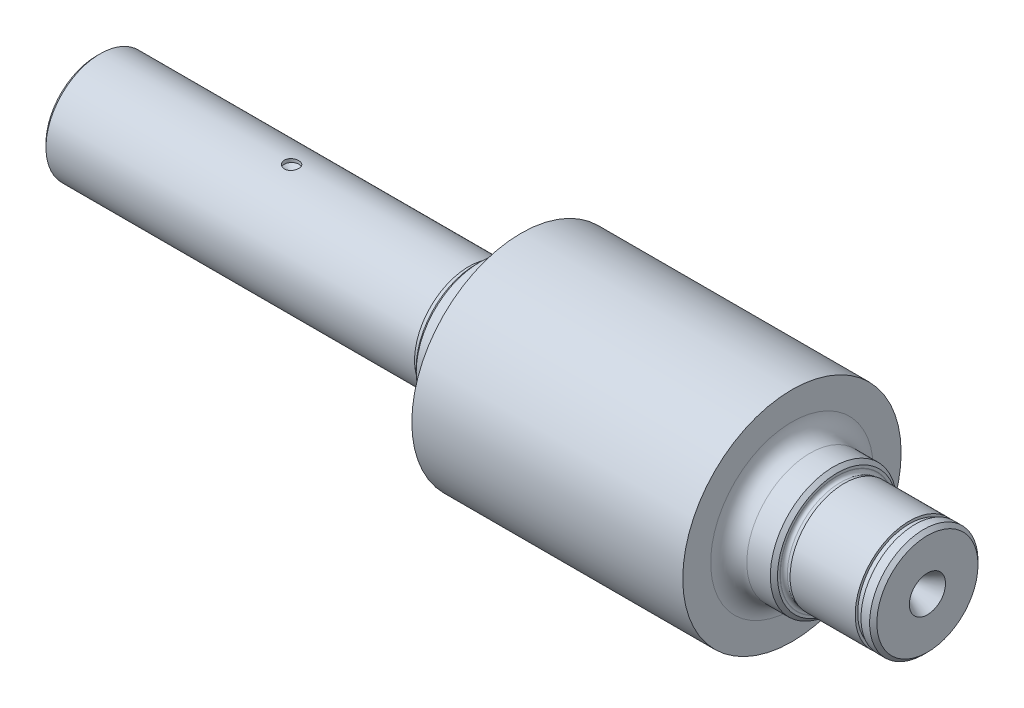
ISO-10303-21;
HEADER;
FILE_DESCRIPTION(('STEP AP214'),'2;1');
FILE_NAME('part.step','',(''),(''),'','','');
FILE_SCHEMA(('AUTOMOTIVE_DESIGN { 1 0 10303 214 1 1 1 1 }'));
ENDSEC;
DATA;
#1=APPLICATION_CONTEXT('core data for automotive mechanical design processes');
#2=APPLICATION_PROTOCOL_DEFINITION('international standard','automotive_design',2000,#1);
#3=PRODUCT_CONTEXT('',#1,'mechanical');
#4=PRODUCT('Part','Part','',(#3));
#5=PRODUCT_RELATED_PRODUCT_CATEGORY('part','',(#4));
#6=PRODUCT_DEFINITION_FORMATION('','',#4);
#7=PRODUCT_DEFINITION_CONTEXT('part definition',#1,'design');
#8=PRODUCT_DEFINITION('design','',#6,#7);
#9=PRODUCT_DEFINITION_SHAPE('','',#8);
#10=(LENGTH_UNIT() NAMED_UNIT(*) SI_UNIT(.MILLI.,.METRE.));
#11=(NAMED_UNIT(*) PLANE_ANGLE_UNIT() SI_UNIT($,.RADIAN.));
#12=(NAMED_UNIT(*) SI_UNIT($,.STERADIAN.) SOLID_ANGLE_UNIT());
#13=UNCERTAINTY_MEASURE_WITH_UNIT(LENGTH_MEASURE(1.E-05),#10,'distance_accuracy_value','');
#14=(GEOMETRIC_REPRESENTATION_CONTEXT(3) GLOBAL_UNCERTAINTY_ASSIGNED_CONTEXT((#13)) GLOBAL_UNIT_ASSIGNED_CONTEXT((#10,
#11,#12)) REPRESENTATION_CONTEXT('',''));
#15=CARTESIAN_POINT('',(0.,0.,0.));
#16=DIRECTION('',(0.,0.,1.));
#17=DIRECTION('',(1.,0.,0.));
#18=AXIS2_PLACEMENT_3D('',#15,#16,#17);
#19=CARTESIAN_POINT('',(230.,15.,0.));
#20=DIRECTION('',(1.,0.,0.));
#21=DIRECTION('',(0.,0.,-1.));
#22=AXIS2_PLACEMENT_3D('',#19,#20,#21);
#23=PLANE('',#22);
#24=CARTESIAN_POINT('',(230.,0.,0.));
#25=DIRECTION('',(1.,0.,0.));
#26=DIRECTION('',(0.,0.,-1.));
#27=AXIS2_PLACEMENT_3D('',#24,#25,#26);
#28=CIRCLE('',#27,5.);
#29=CARTESIAN_POINT('',(230.,0.,-5.00000000000001));
#30=VERTEX_POINT('',#29);
#31=EDGE_CURVE('E716',#30,#30,#28,.T.);
#32=ORIENTED_EDGE('',*,*,#31,.F.);
#33=EDGE_LOOP('',(#32));
#34=FACE_BOUND('',#33,.T.);
#35=CARTESIAN_POINT('',(230.,0.,0.));
#36=DIRECTION('',(1.,0.,0.));
#37=DIRECTION('',(0.,0.,-1.));
#38=AXIS2_PLACEMENT_3D('',#35,#36,#37);
#39=CIRCLE('',#38,14.);
#40=CARTESIAN_POINT('',(230.,0.,-14.));
#41=VERTEX_POINT('',#40);
#42=EDGE_CURVE('E235',#41,#41,#39,.T.);
#43=ORIENTED_EDGE('',*,*,#42,.T.);
#44=EDGE_LOOP('',(#43));
#45=FACE_BOUND('',#44,.T.);
#46=ADVANCED_FACE('F40',(#34,#45),#23,.T.);
#47=CARTESIAN_POINT('',(230.,0.,0.));
#48=DIRECTION('',(1.,0.,0.));
#49=DIRECTION('',(0.,0.,-1.));
#50=AXIS2_PLACEMENT_3D('',#47,#48,#49);
#51=CYLINDRICAL_SURFACE('',#50,15.);
#52=CARTESIAN_POINT('',(229.,0.,0.));
#53=DIRECTION('',(1.,0.,0.));
#54=DIRECTION('',(0.,0.,-1.));
#55=AXIS2_PLACEMENT_3D('',#52,#53,#54);
#56=CIRCLE('',#55,15.);
#57=CARTESIAN_POINT('',(229.,0.,-15.));
#58=VERTEX_POINT('',#57);
#59=EDGE_CURVE('E55',#58,#58,#56,.F.);
#60=ORIENTED_EDGE('',*,*,#59,.T.);
#61=EDGE_LOOP('',(#60));
#62=FACE_BOUND('',#61,.T.);
#63=CARTESIAN_POINT('',(226.6,0.,0.));
#64=DIRECTION('',(1.,0.,0.));
#65=DIRECTION('',(0.,0.,-1.));
#66=AXIS2_PLACEMENT_3D('',#63,#64,#65);
#67=CIRCLE('',#66,15.);
#68=CARTESIAN_POINT('',(226.6,0.,-15.));
#69=VERTEX_POINT('',#68);
#70=EDGE_CURVE('E252',#69,#69,#67,.T.);
#71=ORIENTED_EDGE('',*,*,#70,.T.);
#72=EDGE_LOOP('',(#71));
#73=FACE_BOUND('',#72,.T.);
#74=ADVANCED_FACE('F185',(#62,#73),#51,.T.);
#75=CARTESIAN_POINT('',(226.6,15.,0.));
#76=DIRECTION('',(-1.,0.,0.));
#77=DIRECTION('',(0.,0.,1.));
#78=AXIS2_PLACEMENT_3D('',#75,#76,#77);
#79=PLANE('',#78);
#80=CARTESIAN_POINT('',(226.6,0.,0.));
#81=DIRECTION('',(1.,0.,0.));
#82=DIRECTION('',(0.,0.,-1.));
#83=AXIS2_PLACEMENT_3D('',#80,#81,#82);
#84=CIRCLE('',#83,14.3);
#85=CARTESIAN_POINT('',(226.6,0.,-14.3));
#86=VERTEX_POINT('',#85);
#87=EDGE_CURVE('E256',#86,#86,#84,.T.);
#88=ORIENTED_EDGE('',*,*,#87,.T.);
#89=EDGE_LOOP('',(#88));
#90=FACE_BOUND('',#89,.T.);
#91=ORIENTED_EDGE('',*,*,#70,.F.);
#92=EDGE_LOOP('',(#91));
#93=FACE_BOUND('',#92,.T.);
#94=ADVANCED_FACE('F191',(#90,#93),#79,.T.);
#95=CARTESIAN_POINT('',(230.,0.,0.));
#96=DIRECTION('',(1.,0.,0.));
#97=DIRECTION('',(0.,0.,-1.));
#98=AXIS2_PLACEMENT_3D('',#95,#96,#97);
#99=CYLINDRICAL_SURFACE('',#98,14.3);
#100=CARTESIAN_POINT('',(225.,0.,0.));
#101=DIRECTION('',(1.,0.,0.));
#102=DIRECTION('',(0.,0.,-1.));
#103=AXIS2_PLACEMENT_3D('',#100,#101,#102);
#104=CIRCLE('',#103,14.3);
#105=CARTESIAN_POINT('',(225.,0.,-14.3));
#106=VERTEX_POINT('',#105);
#107=EDGE_CURVE('E264',#106,#106,#104,.T.);
#108=ORIENTED_EDGE('',*,*,#107,.T.);
#109=EDGE_LOOP('',(#108));
#110=FACE_BOUND('',#109,.T.);
#111=ORIENTED_EDGE('',*,*,#87,.F.);
#112=EDGE_LOOP('',(#111));
#113=FACE_BOUND('',#112,.T.);
#114=ADVANCED_FACE('F352',(#110,#113),#99,.T.);
#115=CARTESIAN_POINT('',(225.,14.3,0.));
#116=DIRECTION('',(1.,0.,0.));
#117=DIRECTION('',(0.,0.,-1.));
#118=AXIS2_PLACEMENT_3D('',#115,#116,#117);
#119=PLANE('',#118);
#120=CARTESIAN_POINT('',(225.,0.,0.));
#121=DIRECTION('',(1.,0.,0.));
#122=DIRECTION('',(0.,0.,-1.));
#123=AXIS2_PLACEMENT_3D('',#120,#121,#122);
#124=CIRCLE('',#123,15.);
#125=CARTESIAN_POINT('',(225.,0.,-15.));
#126=VERTEX_POINT('',#125);
#127=EDGE_CURVE('E345',#126,#126,#124,.T.);
#128=ORIENTED_EDGE('',*,*,#127,.T.);
#129=EDGE_LOOP('',(#128));
#130=FACE_BOUND('',#129,.T.);
#131=ORIENTED_EDGE('',*,*,#107,.F.);
#132=EDGE_LOOP('',(#131));
#133=FACE_BOUND('',#132,.T.);
#134=ADVANCED_FACE('F355',(#130,#133),#119,.T.);
#135=CARTESIAN_POINT('',(230.,0.,0.));
#136=DIRECTION('',(1.,0.,0.));
#137=DIRECTION('',(0.,0.,-1.));
#138=AXIS2_PLACEMENT_3D('',#135,#136,#137);
#139=CYLINDRICAL_SURFACE('',#138,15.);
#140=CARTESIAN_POINT('',(206.972773426939,0.,0.));
#141=DIRECTION('',(1.,0.,0.));
#142=DIRECTION('',(0.,0.,-1.));
#143=AXIS2_PLACEMENT_3D('',#140,#141,#142);
#144=CIRCLE('',#143,15.);
#145=CARTESIAN_POINT('',(206.972773426939,0.,-15.));
#146=VERTEX_POINT('',#145);
#147=EDGE_CURVE('E341',#146,#146,#144,.T.);
#148=ORIENTED_EDGE('',*,*,#147,.T.);
#149=EDGE_LOOP('',(#148));
#150=FACE_BOUND('',#149,.T.);
#151=ORIENTED_EDGE('',*,*,#127,.F.);
#152=EDGE_LOOP('',(#151));
#153=FACE_BOUND('',#152,.T.);
#154=ADVANCED_FACE('F357',(#150,#153),#139,.T.);
#155=CARTESIAN_POINT('',(206.972773426939,0.,0.));
#156=DIRECTION('',(1.,0.,0.));
#157=DIRECTION('',(0.,0.,-1.));
#158=AXIS2_PLACEMENT_3D('',#155,#156,#157);
#159=CONICAL_SURFACE('',#158,15.,0.261799387799148);
#160=CARTESIAN_POINT('',(205.954891422681,0.,0.));
#161=DIRECTION('',(1.,0.,0.));
#162=DIRECTION('',(0.,0.,-1.));
#163=AXIS2_PLACEMENT_3D('',#160,#161,#162);
#164=CIRCLE('',#163,14.7272593389688);
#165=CARTESIAN_POINT('',(205.954891422681,0.,-14.7272593389688));
#166=VERTEX_POINT('',#165);
#167=EDGE_CURVE('E337',#166,#166,#164,.T.);
#168=ORIENTED_EDGE('',*,*,#167,.T.);
#169=EDGE_LOOP('',(#168));
#170=FACE_BOUND('',#169,.T.);
#171=ORIENTED_EDGE('',*,*,#147,.F.);
#172=EDGE_LOOP('',(#171));
#173=FACE_BOUND('',#172,.T.);
#174=ADVANCED_FACE('F364',(#170,#173),#159,.T.);
#175=CARTESIAN_POINT('',(205.747836186599,0.,0.));
#176=DIRECTION('',(1.,0.,0.));
#177=DIRECTION('',(0.,0.,-1.));
#178=AXIS2_PLACEMENT_3D('',#175,#176,#177);
#179=TOROIDAL_SURFACE('',#178,15.5,0.799999999999995);
#180=CARTESIAN_POINT('',(204.975095525567,0.,0.));
#181=DIRECTION('',(1.,0.,0.));
#182=DIRECTION('',(0.,0.,-1.));
#183=AXIS2_PLACEMENT_3D('',#180,#181,#182);
#184=CIRCLE('',#183,15.7070552360819);
#185=CARTESIAN_POINT('',(204.975095525567,0.,-15.707055236082));
#186=VERTEX_POINT('',#185);
#187=EDGE_CURVE('E333',#186,#186,#184,.T.);
#188=ORIENTED_EDGE('',*,*,#187,.T.);
#189=EDGE_LOOP('',(#188));
#190=FACE_BOUND('',#189,.T.);
#191=ORIENTED_EDGE('',*,*,#167,.F.);
#192=EDGE_LOOP('',(#191));
#193=FACE_BOUND('',#192,.T.);
#194=ADVANCED_FACE('F399',(#190,#193),#179,.F.);
#195=CARTESIAN_POINT('',(204.975095525567,0.,0.));
#196=DIRECTION('',(1.,0.,0.));
#197=DIRECTION('',(0.,0.,-1.));
#198=AXIS2_PLACEMENT_3D('',#195,#196,#197);
#199=CONICAL_SURFACE('',#198,15.7070552360819,1.30899693899589);
#200=CARTESIAN_POINT('',(205.,0.,0.));
#201=DIRECTION('',(1.,0.,0.));
#202=DIRECTION('',(0.,0.,-1.));
#203=AXIS2_PLACEMENT_3D('',#200,#201,#202);
#204=CIRCLE('',#203,15.8);
#205=CARTESIAN_POINT('',(205.,0.,-15.8000000000001));
#206=VERTEX_POINT('',#205);
#207=EDGE_CURVE('E323',#206,#206,#204,.T.);
#208=ORIENTED_EDGE('',*,*,#207,.T.);
#209=EDGE_LOOP('',(#208));
#210=FACE_BOUND('',#209,.T.);
#211=ORIENTED_EDGE('',*,*,#187,.F.);
#212=EDGE_LOOP('',(#211));
#213=FACE_BOUND('',#212,.T.);
#214=ADVANCED_FACE('F408',(#210,#213),#199,.F.);
#215=CARTESIAN_POINT('',(205.,17.5,0.));
#216=DIRECTION('',(1.,0.,0.));
#217=DIRECTION('',(0.,0.,-1.));
#218=AXIS2_PLACEMENT_3D('',#215,#216,#217);
#219=PLANE('',#218);
#220=CARTESIAN_POINT('',(205.,0.,0.));
#221=DIRECTION('',(1.,0.,0.));
#222=DIRECTION('',(0.,0.,-1.));
#223=AXIS2_PLACEMENT_3D('',#220,#221,#222);
#224=CIRCLE('',#223,16.5);
#225=CARTESIAN_POINT('',(205.,0.,-16.5));
#226=VERTEX_POINT('',#225);
#227=EDGE_CURVE('E279',#226,#226,#224,.T.);
#228=ORIENTED_EDGE('',*,*,#227,.T.);
#229=EDGE_LOOP('',(#228));
#230=FACE_BOUND('',#229,.T.);
#231=ORIENTED_EDGE('',*,*,#207,.F.);
#232=EDGE_LOOP('',(#231));
#233=FACE_BOUND('',#232,.T.);
#234=ADVANCED_FACE('F418',(#230,#233),#219,.T.);
#235=CARTESIAN_POINT('',(230.,0.,0.));
#236=DIRECTION('',(1.,0.,0.));
#237=DIRECTION('',(0.,0.,-1.));
#238=AXIS2_PLACEMENT_3D('',#235,#236,#237);
#239=CYLINDRICAL_SURFACE('',#238,17.5);
#240=CARTESIAN_POINT('',(204.,0.,0.));
#241=DIRECTION('',(1.,0.,0.));
#242=DIRECTION('',(0.,0.,-1.));
#243=AXIS2_PLACEMENT_3D('',#240,#241,#242);
#244=CIRCLE('',#243,17.5);
#245=CARTESIAN_POINT('',(204.,0.,-17.5));
#246=VERTEX_POINT('',#245);
#247=EDGE_CURVE('E283',#246,#246,#244,.F.);
#248=ORIENTED_EDGE('',*,*,#247,.T.);
#249=EDGE_LOOP('',(#248));
#250=FACE_BOUND('',#249,.T.);
#251=CARTESIAN_POINT('',(197.5,0.,0.));
#252=DIRECTION('',(1.,0.,0.));
#253=DIRECTION('',(0.,0.,-1.));
#254=AXIS2_PLACEMENT_3D('',#251,#252,#253);
#255=CIRCLE('',#254,17.5);
#256=CARTESIAN_POINT('',(197.5,0.,-17.5));
#257=VERTEX_POINT('',#256);
#258=EDGE_CURVE('E255',#257,#257,#255,.T.);
#259=ORIENTED_EDGE('',*,*,#258,.T.);
#260=EDGE_LOOP('',(#259));
#261=FACE_BOUND('',#260,.T.);
#262=ADVANCED_FACE('F428',(#250,#261),#239,.T.);
#263=CARTESIAN_POINT('',(192.5,30.2250000000001,0.));
#264=DIRECTION('',(1.,0.,0.));
#265=DIRECTION('',(0.,0.,-1.));
#266=AXIS2_PLACEMENT_3D('',#263,#264,#265);
#267=PLANE('',#266);
#268=CARTESIAN_POINT('',(192.5,0.,0.));
#269=DIRECTION('',(1.,0.,0.));
#270=DIRECTION('',(0.,0.,-1.));
#271=AXIS2_PLACEMENT_3D('',#268,#269,#270);
#272=CIRCLE('',#271,22.5);
#273=CARTESIAN_POINT('',(192.5,0.,-22.5));
#274=VERTEX_POINT('',#273);
#275=EDGE_CURVE('E261',#274,#274,#272,.F.);
#276=ORIENTED_EDGE('',*,*,#275,.T.);
#277=EDGE_LOOP('',(#276));
#278=FACE_BOUND('',#277,.T.);
#279=CARTESIAN_POINT('',(192.5,0.,0.));
#280=DIRECTION('',(1.,0.,0.));
#281=DIRECTION('',(0.,0.,-1.));
#282=AXIS2_PLACEMENT_3D('',#279,#280,#281);
#283=CIRCLE('',#282,30.225);
#284=CARTESIAN_POINT('',(192.5,0.,-30.2250000000001));
#285=VERTEX_POINT('',#284);
#286=EDGE_CURVE('E317',#285,#285,#283,.T.);
#287=ORIENTED_EDGE('',*,*,#286,.T.);
#288=EDGE_LOOP('',(#287));
#289=FACE_BOUND('',#288,.T.);
#290=ADVANCED_FACE('F438',(#278,#289),#267,.T.);
#291=CARTESIAN_POINT('',(230.,0.,0.));
#292=DIRECTION('',(1.,0.,0.));
#293=DIRECTION('',(0.,0.,-1.));
#294=AXIS2_PLACEMENT_3D('',#291,#292,#293);
#295=CYLINDRICAL_SURFACE('',#294,30.225);
#296=CARTESIAN_POINT('',(117.5,0.,0.));
#297=DIRECTION('',(1.,0.,0.));
#298=DIRECTION('',(0.,0.,-1.));
#299=AXIS2_PLACEMENT_3D('',#296,#297,#298);
#300=CIRCLE('',#299,30.225);
#301=CARTESIAN_POINT('',(117.5,0.,-30.225));
#302=VERTEX_POINT('',#301);
#303=EDGE_CURVE('E314',#302,#302,#300,.T.);
#304=ORIENTED_EDGE('',*,*,#303,.T.);
#305=EDGE_LOOP('',(#304));
#306=FACE_BOUND('',#305,.T.);
#307=ORIENTED_EDGE('',*,*,#286,.F.);
#308=EDGE_LOOP('',(#307));
#309=FACE_BOUND('',#308,.T.);
#310=ADVANCED_FACE('F310',(#306,#309),#295,.T.);
#311=CARTESIAN_POINT('',(117.5,17.5,0.));
#312=DIRECTION('',(-1.,0.,0.));
#313=DIRECTION('',(0.,0.,1.));
#314=AXIS2_PLACEMENT_3D('',#311,#312,#313);
#315=PLANE('',#314);
#316=CARTESIAN_POINT('',(117.5,0.,0.));
#317=DIRECTION('',(-1.,0.,0.));
#318=DIRECTION('',(0.,0.,1.));
#319=AXIS2_PLACEMENT_3D('',#316,#317,#318);
#320=CIRCLE('',#319,22.5);
#321=CARTESIAN_POINT('',(117.5,0.,22.5));
#322=VERTEX_POINT('',#321);
#323=EDGE_CURVE('E271',#322,#322,#320,.F.);
#324=ORIENTED_EDGE('',*,*,#323,.T.);
#325=EDGE_LOOP('',(#324));
#326=FACE_BOUND('',#325,.T.);
#327=ORIENTED_EDGE('',*,*,#303,.F.);
#328=EDGE_LOOP('',(#327));
#329=FACE_BOUND('',#328,.T.);
#330=ADVANCED_FACE('F302',(#326,#329),#315,.T.);
#331=CARTESIAN_POINT('',(230.,0.,0.));
#332=DIRECTION('',(1.,0.,0.));
#333=DIRECTION('',(0.,0.,-1.));
#334=AXIS2_PLACEMENT_3D('',#331,#332,#333);
#335=CYLINDRICAL_SURFACE('',#334,17.5);
#336=CARTESIAN_POINT('',(106.,0.,0.));
#337=DIRECTION('',(-1.,0.,0.));
#338=DIRECTION('',(0.,0.,1.));
#339=AXIS2_PLACEMENT_3D('',#336,#337,#338);
#340=CIRCLE('',#339,17.5);
#341=CARTESIAN_POINT('',(106.,0.,17.5));
#342=VERTEX_POINT('',#341);
#343=EDGE_CURVE('E287',#342,#342,#340,.F.);
#344=ORIENTED_EDGE('',*,*,#343,.T.);
#345=EDGE_LOOP('',(#344));
#346=FACE_BOUND('',#345,.T.);
#347=CARTESIAN_POINT('',(112.5,0.,0.));
#348=DIRECTION('',(-1.,0.,0.));
#349=DIRECTION('',(0.,0.,1.));
#350=AXIS2_PLACEMENT_3D('',#347,#348,#349);
#351=CIRCLE('',#350,17.5);
#352=CARTESIAN_POINT('',(112.5,0.,17.5));
#353=VERTEX_POINT('',#352);
#354=EDGE_CURVE('E275',#353,#353,#351,.T.);
#355=ORIENTED_EDGE('',*,*,#354,.T.);
#356=EDGE_LOOP('',(#355));
#357=FACE_BOUND('',#356,.T.);
#358=ADVANCED_FACE('F299',(#346,#357),#335,.T.);
#359=CARTESIAN_POINT('',(105.,15.8,0.));
#360=DIRECTION('',(-1.,0.,0.));
#361=DIRECTION('',(0.,0.,1.));
#362=AXIS2_PLACEMENT_3D('',#359,#360,#361);
#363=PLANE('',#362);
#364=CARTESIAN_POINT('',(105.,0.,0.));
#365=DIRECTION('',(-1.,0.,0.));
#366=DIRECTION('',(0.,0.,1.));
#367=AXIS2_PLACEMENT_3D('',#364,#365,#366);
#368=CIRCLE('',#367,16.5);
#369=CARTESIAN_POINT('',(105.,0.,16.5));
#370=VERTEX_POINT('',#369);
#371=EDGE_CURVE('E241',#370,#370,#368,.T.);
#372=ORIENTED_EDGE('',*,*,#371,.T.);
#373=EDGE_LOOP('',(#372));
#374=FACE_BOUND('',#373,.T.);
#375=CARTESIAN_POINT('',(105.,0.,0.));
#376=DIRECTION('',(1.,0.,0.));
#377=DIRECTION('',(0.,0.,-1.));
#378=AXIS2_PLACEMENT_3D('',#375,#376,#377);
#379=CIRCLE('',#378,15.8);
#380=CARTESIAN_POINT('',(105.,0.,-15.8));
#381=VERTEX_POINT('',#380);
#382=EDGE_CURVE('E318',#381,#381,#379,.T.);
#383=ORIENTED_EDGE('',*,*,#382,.T.);
#384=EDGE_LOOP('',(#383));
#385=FACE_BOUND('',#384,.T.);
#386=ADVANCED_FACE('F294',(#374,#385),#363,.T.);
#387=CARTESIAN_POINT('',(105.,0.,0.));
#388=DIRECTION('',(-1.,0.,0.));
#389=DIRECTION('',(0.,0.,1.));
#390=AXIS2_PLACEMENT_3D('',#387,#388,#389);
#391=CONICAL_SURFACE('',#390,15.8,1.30899693899589);
#392=CARTESIAN_POINT('',(105.024904474433,0.,0.));
#393=DIRECTION('',(1.,0.,0.));
#394=DIRECTION('',(0.,0.,-1.));
#395=AXIS2_PLACEMENT_3D('',#392,#393,#394);
#396=CIRCLE('',#395,15.7070552360819);
#397=CARTESIAN_POINT('',(105.024904474433,0.,-15.7070552360819));
#398=VERTEX_POINT('',#397);
#399=EDGE_CURVE('E326',#398,#398,#396,.T.);
#400=ORIENTED_EDGE('',*,*,#399,.T.);
#401=EDGE_LOOP('',(#400));
#402=FACE_BOUND('',#401,.T.);
#403=ORIENTED_EDGE('',*,*,#382,.F.);
#404=EDGE_LOOP('',(#403));
#405=FACE_BOUND('',#404,.T.);
#406=ADVANCED_FACE('F477',(#402,#405),#391,.F.);
#407=CARTESIAN_POINT('',(104.252163813401,0.,0.));
#408=DIRECTION('',(1.,0.,0.));
#409=DIRECTION('',(0.,0.,-1.));
#410=AXIS2_PLACEMENT_3D('',#407,#408,#409);
#411=TOROIDAL_SURFACE('',#410,15.5,0.799999999999998);
#412=CARTESIAN_POINT('',(104.045108577319,0.,0.));
#413=DIRECTION('',(1.,0.,0.));
#414=DIRECTION('',(0.,0.,-1.));
#415=AXIS2_PLACEMENT_3D('',#412,#413,#414);
#416=CIRCLE('',#415,14.7272593389687);
#417=CARTESIAN_POINT('',(104.045108577319,0.,-14.7272593389688));
#418=VERTEX_POINT('',#417);
#419=EDGE_CURVE('E744',#418,#418,#416,.T.);
#420=ORIENTED_EDGE('',*,*,#419,.T.);
#421=EDGE_LOOP('',(#420));
#422=FACE_BOUND('',#421,.T.);
#423=ORIENTED_EDGE('',*,*,#399,.F.);
#424=EDGE_LOOP('',(#423));
#425=FACE_BOUND('',#424,.T.);
#426=ADVANCED_FACE('F486',(#422,#425),#411,.F.);
#427=CARTESIAN_POINT('',(104.045108577319,0.,0.));
#428=DIRECTION('',(-1.,0.,0.));
#429=DIRECTION('',(0.,0.,1.));
#430=AXIS2_PLACEMENT_3D('',#427,#428,#429);
#431=CONICAL_SURFACE('',#430,14.7272593389687,0.261799387799151);
#432=CARTESIAN_POINT('',(103.027226573061,0.,0.));
#433=DIRECTION('',(1.,0.,0.));
#434=DIRECTION('',(0.,0.,-1.));
#435=AXIS2_PLACEMENT_3D('',#432,#433,#434);
#436=CIRCLE('',#435,15.);
#437=CARTESIAN_POINT('',(103.027226573061,0.,-15.));
#438=VERTEX_POINT('',#437);
#439=EDGE_CURVE('E741',#438,#438,#436,.T.);
#440=ORIENTED_EDGE('',*,*,#439,.T.);
#441=EDGE_LOOP('',(#440));
#442=FACE_BOUND('',#441,.T.);
#443=ORIENTED_EDGE('',*,*,#419,.F.);
#444=EDGE_LOOP('',(#443));
#445=FACE_BOUND('',#444,.T.);
#446=ADVANCED_FACE('F496',(#442,#445),#431,.T.);
#447=CARTESIAN_POINT('',(230.,0.,0.));
#448=DIRECTION('',(1.,0.,0.));
#449=DIRECTION('',(0.,0.,-1.));
#450=AXIS2_PLACEMENT_3D('',#447,#448,#449);
#451=CYLINDRICAL_SURFACE('',#450,15.);
#452=CARTESIAN_POINT('',(69.4172163416592,-14.456832294801,-4.00000000000002));
#453=CARTESIAN_POINT('',(69.459408304586,-14.4940102085018,-3.86563939819163));
#454=CARTESIAN_POINT('',(69.4991882500075,-14.5294992585215,-3.73007622827559));
#455=CARTESIAN_POINT('',(69.5740132746294,-14.5969316316148,-3.45678842908689));
#456=CARTESIAN_POINT('',(69.6090586663312,-14.6288751886816,-3.31906394314095));
#457=CARTESIAN_POINT('',(69.7072060852066,-14.7191164670565,-2.90310802276085));
#458=CARTESIAN_POINT('',(69.7633559780424,-14.7718574953061,-2.62197657787046));
#459=CARTESIAN_POINT('',(69.8577302392395,-14.8614995829399,-2.05393493669148));
#460=CARTESIAN_POINT('',(69.8959334898532,-14.8983819772292,-1.76701834481836));
#461=CARTESIAN_POINT('',(69.9547937150606,-14.9555553344423,-1.1897411974079));
#462=CARTESIAN_POINT('',(69.9754502855791,-14.9758459152795,-0.899380562715236));
#463=CARTESIAN_POINT('',(69.9994760327923,-14.9994695797976,-0.317361387970037));
#464=CARTESIAN_POINT('',(70.0028510283414,-15.0028083712877,-0.0257033178853822));
#465=CARTESIAN_POINT('',(69.992374551707,-14.9924866119554,0.557002544645724));
#466=CARTESIAN_POINT('',(69.9785232546876,-14.9788262339874,0.84805034326752));
#467=CARTESIAN_POINT('',(69.9334568963986,-14.9347878172996,1.42696496937243));
#468=CARTESIAN_POINT('',(69.9022747625226,-14.9044414819125,1.71483677645208));
#469=CARTESIAN_POINT('',(69.8221943302822,-14.8276090018586,2.2858099302674));
#470=CARTESIAN_POINT('',(69.7733047219255,-14.7811307744424,2.56891354581531));
#471=CARTESIAN_POINT('',(69.674675947877,-14.689155986986,3.04441798282694));
#472=CARTESIAN_POINT('',(69.6295896556897,-14.647546132323,3.23855571492286));
#473=CARTESIAN_POINT('',(69.5302983542653,-14.5573310603719,3.62257742659896));
#474=CARTESIAN_POINT('',(69.4761040217084,-14.5087340431443,3.81246609509026));
#475=CARTESIAN_POINT('',(69.4172163416592,-14.456832294801,4.));
#476=B_SPLINE_CURVE_WITH_KNOTS('',3,(#452,#453,#454,#455,#456,#457,#458,#459,#460,#461,#462,
#463,#464,#465,#466,#467,#468,#469,#470,#471,#472,#473,#474,#475),.UNSPECIFIED.,.F.,.F.,(4,2,2,
2,2,2,2,2,2,2,2,4),(0.,0.436888414311642,0.873747977972189,1.74708621826149,2.62144955412009,
3.4958330247904,4.3699220636956,5.24400221458235,6.11642732259786,6.98842486364761,
7.59888261761432,8.20862970568574),.UNSPECIFIED.);
#477=CARTESIAN_POINT('',(69.4172163416591,-14.456832294801,-4.00000000000002));
#478=VERTEX_POINT('',#477);
#479=CARTESIAN_POINT('',(69.4172163416592,-14.4568322948009,3.99999999999999));
#480=VERTEX_POINT('',#479);
#481=EDGE_CURVE('E118',#478,#480,#476,.T.);
#482=ORIENTED_EDGE('',*,*,#481,.F.);
#483=DIRECTION('',(1.,0.,0.));
#484=VECTOR('',#483,1.);
#485=CARTESIAN_POINT('',(230.,-14.456832294801,-4.00000000000001));
#486=LINE('',#485,#484);
#487=CARTESIAN_POINT('',(1.00000000000008,-14.456832294801,-4.00000000000001));
#488=VERTEX_POINT('',#487);
#489=EDGE_CURVE('E114',#478,#488,#486,.F.);
#490=ORIENTED_EDGE('',*,*,#489,.T.);
#491=CARTESIAN_POINT('',(1.00000000000008,0.,0.));
#492=DIRECTION('',(-1.,0.,0.));
#493=DIRECTION('',(0.,0.,1.));
#494=AXIS2_PLACEMENT_3D('',#491,#492,#493);
#495=CIRCLE('',#494,15.);
#496=CARTESIAN_POINT('',(1.00000000000008,-14.456832294801,3.99999999999999));
#497=VERTEX_POINT('',#496);
#498=EDGE_CURVE('E231',#488,#497,#495,.F.);
#499=ORIENTED_EDGE('',*,*,#498,.T.);
#500=DIRECTION('',(1.,0.,0.));
#501=VECTOR('',#500,1.);
#502=CARTESIAN_POINT('',(230.,-14.456832294801,4.));
#503=LINE('',#502,#501);
#504=EDGE_CURVE('E62',#497,#480,#503,.T.);
#505=ORIENTED_EDGE('',*,*,#504,.T.);
#506=EDGE_LOOP('',(#482,#490,#499,#505));
#507=FACE_BOUND('',#506,.T.);
#508=CARTESIAN_POINT('',(54.,14.8660687473186,2.));
#509=CARTESIAN_POINT('',(54.1118038554675,14.8660704451043,1.99999528594759));
#510=CARTESIAN_POINT('',(54.2236760331162,14.8673436464034,1.99059326704128));
#511=CARTESIAN_POINT('',(54.4443024623359,14.8722964859732,1.9532379626613));
#512=CARTESIAN_POINT('',(54.5530534049172,14.8759785863295,1.92526569649113));
#513=CARTESIAN_POINT('',(54.7642113682263,14.8853249214529,1.85161311140264));
#514=CARTESIAN_POINT('',(54.8666228116177,14.8909877556206,1.80594530275044));
#515=CARTESIAN_POINT('',(55.0623110757096,14.9036558225185,1.69822564880686));
#516=CARTESIAN_POINT('',(55.155589358938,14.9106608397869,1.63617643263469));
#517=CARTESIAN_POINT('',(55.3309734546685,14.9252737732074,1.49703370489517));
#518=CARTESIAN_POINT('',(55.4130128656794,14.9328848849373,1.4198568227486));
#519=CARTESIAN_POINT('',(55.5630162454564,14.9478237625823,1.2528292287261));
#520=CARTESIAN_POINT('',(55.6309794914762,14.9551515139325,1.16297786647198));
#521=CARTESIAN_POINT('',(55.7511418417164,14.9687309976037,0.97273172492761));
#522=CARTESIAN_POINT('',(55.8032804892902,14.9749785650228,0.87229843771122));
#523=CARTESIAN_POINT('',(55.8899261641808,14.9856585341581,0.664003816037366));
#524=CARTESIAN_POINT('',(55.9244339323777,14.990091012146,0.556142793922399));
#525=CARTESIAN_POINT('',(55.9746389095803,14.9966188619561,0.336735375014088));
#526=CARTESIAN_POINT('',(55.9904468150119,14.9987279820508,0.225214723469897));
#527=CARTESIAN_POINT('',(56.0031466087368,15.0004184797152,0.00108500230365809));
#528=CARTESIAN_POINT('',(56.0000393377365,14.9999999696283,-0.111524018722462));
#529=CARTESIAN_POINT('',(55.975085269459,14.9966934411691,-0.333880124465768));
#530=CARTESIAN_POINT('',(55.9533575352543,14.9938211133781,-0.443640837361787));
#531=CARTESIAN_POINT('',(55.8919656729785,14.9859472409229,-0.657944122712558));
#532=CARTESIAN_POINT('',(55.8523011648319,14.9809456511403,-0.76248658454184));
#533=CARTESIAN_POINT('',(55.7560365588782,14.9693481900417,-0.963751808424128));
#534=CARTESIAN_POINT('',(55.6993853768169,14.9627475214588,-1.06044984935326));
#535=CARTESIAN_POINT('',(55.5707927427171,14.9486895041904,-1.24301169073479));
#536=CARTESIAN_POINT('',(55.4988504933722,14.9412321108429,-1.32887492586682));
#537=CARTESIAN_POINT('',(55.3410521516411,14.9262258809566,-1.48803006154539));
#538=CARTESIAN_POINT('',(55.2550922318064,14.918676784244,-1.56121903353021));
#539=CARTESIAN_POINT('',(55.0720540686274,14.9043949876924,-1.69214693057191));
#540=CARTESIAN_POINT('',(54.974975781197,14.8976622910908,-1.74988579436353));
#541=CARTESIAN_POINT('',(54.7723599996533,14.8857757633434,-1.848282860865));
#542=CARTESIAN_POINT('',(54.6668180954815,14.8806227621479,-1.88893208906707));
#543=CARTESIAN_POINT('',(54.4503219793616,14.8724947546572,-1.95190090044924));
#544=CARTESIAN_POINT('',(54.3393680659734,14.8695196283617,-1.97422149354143));
#545=CARTESIAN_POINT('',(54.116108664995,14.8661064501035,-1.99976160768727));
#546=CARTESIAN_POINT('',(54.0038200696674,14.8656491151163,-2.00312631098812));
#547=CARTESIAN_POINT('',(53.7802807438952,14.867272242967,-1.99104288188796));
#548=CARTESIAN_POINT('',(53.6690299882605,14.8693526440475,-1.97559520729777));
#549=CARTESIAN_POINT('',(53.4511640135944,14.8757992043677,-1.9264480503702));
#550=CARTESIAN_POINT('',(53.3445325069819,14.8801564778765,-1.8928195032336));
#551=CARTESIAN_POINT('',(53.1384210865476,14.8906585901441,-1.80833845080125));
#552=CARTESIAN_POINT('',(53.0389414566763,14.8968034998285,-1.75748526209383));
#553=CARTESIAN_POINT('',(52.8493026895592,14.9102344661952,-1.63964406417211));
#554=CARTESIAN_POINT('',(52.7592029516318,14.9175271378913,-1.572561231663));
#555=CARTESIAN_POINT('',(52.5914890615629,14.9324114351651,-1.42429832312799));
#556=CARTESIAN_POINT('',(52.513875463852,14.9400030739994,-1.34311762143754));
#557=CARTESIAN_POINT('',(52.3728234460789,14.9546894865534,-1.16832754835824));
#558=CARTESIAN_POINT('',(52.3094806836284,14.9617807004972,-1.07464064093252));
#559=CARTESIAN_POINT('',(52.1994317178247,14.974613414783,-0.877872452317615));
#560=CARTESIAN_POINT('',(52.1527251402439,14.980354945485,-0.774791382513697));
#561=CARTESIAN_POINT('',(52.0774307384119,14.9898256469116,-0.562472772523429));
#562=CARTESIAN_POINT('',(52.0487885709164,14.9935608482078,-0.453254784247354));
#563=CARTESIAN_POINT('',(52.010259514539,14.9986231668662,-0.231506493423191));
#564=CARTESIAN_POINT('',(52.0003716572923,14.9999504085613,-0.118976362199819));
#565=CARTESIAN_POINT('',(51.9996517327596,15.0000464724842,0.105269873711589));
#566=CARTESIAN_POINT('',(52.0086725294056,14.9988350491343,0.216985525921879));
#567=CARTESIAN_POINT('',(52.045201041232,14.9940293321986,0.437297443052352));
#568=CARTESIAN_POINT('',(52.0727087305213,14.9904350419501,0.545893712341046));
#569=CARTESIAN_POINT('',(52.1453820470767,14.9812655664247,0.756858234588856));
#570=CARTESIAN_POINT('',(52.1905396264081,14.9756912840831,0.859229301543903));
#571=CARTESIAN_POINT('',(52.2972155496457,14.9631774939599,1.05496407863087));
#572=CARTESIAN_POINT('',(52.3587341956524,14.95623796097,1.14832762239917));
#573=CARTESIAN_POINT('',(52.4969266820036,14.9417029120985,1.32414728606674));
#574=CARTESIAN_POINT('',(52.5737097901392,14.9341029029987,1.40651715716398));
#575=CARTESIAN_POINT('',(52.7400230690473,14.9191386489681,1.55725895587215));
#576=CARTESIAN_POINT('',(52.8295562439212,14.9117744601021,1.62562757530231));
#577=CARTESIAN_POINT('',(53.0192839415709,14.8980810988492,1.74668790978496));
#578=CARTESIAN_POINT('',(53.1195235915101,14.8917566176026,1.79930940429127));
#579=CARTESIAN_POINT('',(53.3274484675171,14.8809136658427,1.88689518281491));
#580=CARTESIAN_POINT('',(53.4351255697594,14.8763932602426,1.92187839666366));
#581=CARTESIAN_POINT('',(53.6194482787255,14.8707513382361,1.96495480378583));
#582=CARTESIAN_POINT('',(53.6949382729681,14.8690042861798,1.97807748135803));
#583=CARTESIAN_POINT('',(53.8469415094705,14.866662414787,1.99560165343182));
#584=CARTESIAN_POINT('',(53.9234547423974,14.8660675849485,2.0000032274232));
#585=CARTESIAN_POINT('',(54.,14.8660687473186,2.));
#586=B_SPLINE_CURVE_WITH_KNOTS('',3,(#508,#509,#510,#511,#512,#513,#514,#515,#516,#517,#518,
#519,#520,#521,#522,#523,#524,#525,#526,#527,#528,#529,#530,#531,#532,#533,#534,#535,#536,#537,
#538,#539,#540,#541,#542,#543,#544,#545,#546,#547,#548,#549,#550,#551,#552,#553,#554,#555,#556,
#557,#558,#559,#560,#561,#562,#563,#564,#565,#566,#567,#568,#569,#570,#571,#572,#573,#574,#575,
#576,#577,#578,#579,#580,#581,#582,#583,#584,#585),.UNSPECIFIED.,.T.,.F.,(4,2,2,2,2,2,2,2,2,2,2,
2,2,2,2,2,2,2,2,2,2,2,2,2,2,2,2,2,2,2,2,2,2,2,2,2,2,2,4),(0.,0.335131889250445,
0.670606846105684,1.00584506276826,1.34102950834957,1.67811595121165,2.01521969762237,
2.35359556525147,2.69195721256928,3.02830569524969,3.36463922864856,3.69883808669953,
4.03304402666679,4.36826528456251,4.70350402584628,5.04134915068958,5.37919561519089,
5.71721927655741,6.05522431149104,6.39063702581932,6.72604157783543,7.06014684818596,
7.3942653761821,7.73038528142333,8.06652010750621,8.40484511764505,8.74316251675154,
9.08045723770336,9.41773454222148,9.75239709856301,10.0870591862064,10.4215688535019,
10.7560846978108,11.0930874236894,11.430169684094,11.768733419821,12.1069330231324,
12.3363794094426,12.5658237044201),.UNSPECIFIED.);
#587=CARTESIAN_POINT('',(54.,14.8660687473186,2.));
#588=VERTEX_POINT('',#587);
#589=EDGE_CURVE('E11',#588,#588,#586,.T.);
#590=ORIENTED_EDGE('',*,*,#589,.F.);
#591=EDGE_LOOP('',(#590));
#592=FACE_BOUND('',#591,.T.);
#593=ORIENTED_EDGE('',*,*,#439,.F.);
#594=EDGE_LOOP('',(#593));
#595=FACE_BOUND('',#594,.T.);
#596=ADVANCED_FACE('F506',(#507,#592,#595),#451,.T.);
#597=CARTESIAN_POINT('',(0.,0.,0.));
#598=DIRECTION('',(-1.,0.,0.));
#599=DIRECTION('',(0.,0.,1.));
#600=AXIS2_PLACEMENT_3D('',#597,#598,#599);
#601=PLANE('',#600);
#602=CARTESIAN_POINT('',(0.,0.,0.));
#603=DIRECTION('',(1.,0.,0.));
#604=DIRECTION('',(0.,0.,-1.));
#605=AXIS2_PLACEMENT_3D('',#602,#603,#604);
#606=CIRCLE('',#605,5.);
#607=CARTESIAN_POINT('',(0.,0.,-5.00000000000001));
#608=VERTEX_POINT('',#607);
#609=EDGE_CURVE('E727',#608,#608,#606,.T.);
#610=ORIENTED_EDGE('',*,*,#609,.T.);
#611=EDGE_LOOP('',(#610));
#612=FACE_BOUND('',#611,.T.);
#613=DIRECTION('',(0.,1.,0.));
#614=VECTOR('',#613,1.);
#615=CARTESIAN_POINT('',(0.,-30.226,-4.00000000000001));
#616=LINE('',#615,#614);
#617=CARTESIAN_POINT('',(0.,-13.4164078649986,-4.00000000000001));
#618=VERTEX_POINT('',#617);
#619=CARTESIAN_POINT('',(0.,-10.9,-4.00000000000001));
#620=VERTEX_POINT('',#619);
#621=EDGE_CURVE('E133',#618,#620,#616,.T.);
#622=ORIENTED_EDGE('',*,*,#621,.T.);
#623=DIRECTION('',(0.,0.,1.));
#624=VECTOR('',#623,1.);
#625=CARTESIAN_POINT('',(0.,-10.9,4.));
#626=LINE('',#625,#624);
#627=CARTESIAN_POINT('',(0.,-10.9,4.));
#628=VERTEX_POINT('',#627);
#629=EDGE_CURVE('E70',#620,#628,#626,.T.);
#630=ORIENTED_EDGE('',*,*,#629,.T.);
#631=DIRECTION('',(0.,1.,0.));
#632=VECTOR('',#631,1.);
#633=CARTESIAN_POINT('',(0.,-30.226,4.));
#634=LINE('',#633,#632);
#635=CARTESIAN_POINT('',(0.,-13.4164078649986,3.99999999999999));
#636=VERTEX_POINT('',#635);
#637=EDGE_CURVE('E130',#636,#628,#634,.T.);
#638=ORIENTED_EDGE('',*,*,#637,.F.);
#639=CARTESIAN_POINT('',(0.,0.,0.));
#640=DIRECTION('',(-1.,0.,0.));
#641=DIRECTION('',(0.,0.,1.));
#642=AXIS2_PLACEMENT_3D('',#639,#640,#641);
#643=CIRCLE('',#642,13.9999999999999);
#644=EDGE_CURVE('E229',#636,#618,#643,.T.);
#645=ORIENTED_EDGE('',*,*,#644,.T.);
#646=EDGE_LOOP('',(#622,#630,#638,#645));
#647=FACE_BOUND('',#646,.T.);
#648=ADVANCED_FACE('F202',(#612,#647),#601,.T.);
#649=CARTESIAN_POINT('',(197.5,0.,0.));
#650=DIRECTION('',(1.,0.,0.));
#651=DIRECTION('',(0.,0.,-1.));
#652=AXIS2_PLACEMENT_3D('',#649,#650,#651);
#653=TOROIDAL_SURFACE('',#652,22.5,5.);
#654=ORIENTED_EDGE('',*,*,#275,.F.);
#655=EDGE_LOOP('',(#654));
#656=FACE_BOUND('',#655,.T.);
#657=ORIENTED_EDGE('',*,*,#258,.F.);
#658=EDGE_LOOP('',(#657));
#659=FACE_BOUND('',#658,.T.);
#660=ADVANCED_FACE('F198',(#656,#659),#653,.F.);
#661=CARTESIAN_POINT('',(112.5,0.,0.));
#662=DIRECTION('',(-1.,0.,0.));
#663=DIRECTION('',(0.,0.,1.));
#664=AXIS2_PLACEMENT_3D('',#661,#662,#663);
#665=TOROIDAL_SURFACE('',#664,22.5,5.);
#666=ORIENTED_EDGE('',*,*,#354,.F.);
#667=EDGE_LOOP('',(#666));
#668=FACE_BOUND('',#667,.T.);
#669=ORIENTED_EDGE('',*,*,#323,.F.);
#670=EDGE_LOOP('',(#669));
#671=FACE_BOUND('',#670,.T.);
#672=ADVANCED_FACE('F201',(#668,#671),#665,.F.);
#673=CARTESIAN_POINT('',(205.,0.,0.));
#674=DIRECTION('',(-1.,0.,0.));
#675=DIRECTION('',(0.,0.,1.));
#676=AXIS2_PLACEMENT_3D('',#673,#674,#675);
#677=CONICAL_SURFACE('',#676,16.5,0.785398163397441);
#678=ORIENTED_EDGE('',*,*,#247,.F.);
#679=EDGE_LOOP('',(#678));
#680=FACE_BOUND('',#679,.T.);
#681=ORIENTED_EDGE('',*,*,#227,.F.);
#682=EDGE_LOOP('',(#681));
#683=FACE_BOUND('',#682,.T.);
#684=ADVANCED_FACE('F206',(#680,#683),#677,.T.);
#685=CARTESIAN_POINT('',(106.,0.,0.));
#686=DIRECTION('',(1.,0.,0.));
#687=DIRECTION('',(0.,0.,-1.));
#688=AXIS2_PLACEMENT_3D('',#685,#686,#687);
#689=CONICAL_SURFACE('',#688,17.5,0.785398163397462);
#690=ORIENTED_EDGE('',*,*,#371,.F.);
#691=EDGE_LOOP('',(#690));
#692=FACE_BOUND('',#691,.T.);
#693=ORIENTED_EDGE('',*,*,#343,.F.);
#694=EDGE_LOOP('',(#693));
#695=FACE_BOUND('',#694,.T.);
#696=ADVANCED_FACE('F213',(#692,#695),#689,.T.);
#697=CARTESIAN_POINT('',(1.00000000000008,0.,0.));
#698=DIRECTION('',(1.,0.,0.));
#699=DIRECTION('',(0.,0.,-1.));
#700=AXIS2_PLACEMENT_3D('',#697,#698,#699);
#701=CONICAL_SURFACE('',#700,15.,0.785398163397454);
#702=CARTESIAN_POINT('',(5.2203895692019,-18.7995578456485,-4.00000000000001));
#703=CARTESIAN_POINT('',(4.82233714525026,-18.3925812437404,-4.00000000000002));
#704=CARTESIAN_POINT('',(4.42455747464529,-17.9853373386334,-4.00000000000002));
#705=CARTESIAN_POINT('',(3.62969940639604,-17.1701663449171,-4.00000000000002));
#706=CARTESIAN_POINT('',(3.23262100828576,-16.7622392567621,-4.00000000000002));
#707=CARTESIAN_POINT('',(2.4393439428594,-15.9455766849074,-4.00000000000002));
#708=CARTESIAN_POINT('',(2.04314522540193,-15.5368412499319,-4.00000000000002));
#709=CARTESIAN_POINT('',(1.25182640803356,-14.7183277222878,-4.00000000000002));
#710=CARTESIAN_POINT('',(0.856706307430172,-14.3085496302889,-4.00000000000002));
#711=CARTESIAN_POINT('',(0.0678220602005008,-13.4876432977329,-4.00000000000002));
#712=CARTESIAN_POINT('',(-0.325942005662699,-13.076514979513,-4.00000000000002));
#713=CARTESIAN_POINT('',(-1.11166095695283,-12.2525382277564,-4.00000000000002));
#714=CARTESIAN_POINT('',(-1.50361585633006,-11.83968980753,-4.00000000000002));
#715=CARTESIAN_POINT('',(-2.28512701347872,-11.0116771501183,-4.00000000000002));
#716=CARTESIAN_POINT('',(-2.67468312322843,-10.5965127729765,-4.00000000000002));
#717=CARTESIAN_POINT('',(-3.25648766627258,-9.97140108966514,-4.00000000000002));
#718=CARTESIAN_POINT('',(-3.45000341881091,-9.76263360290493,-4.00000000000002));
#719=CARTESIAN_POINT('',(-3.83601045083862,-9.3441510928086,-4.00000000000002));
#720=CARTESIAN_POINT('',(-4.02850172282153,-9.13443606255049,-4.00000000000002));
#721=CARTESIAN_POINT('',(-4.22038956920184,-8.92416831857023,-4.00000000000001));
#722=B_SPLINE_CURVE_WITH_KNOTS('',3,(#702,#703,#704,#705,#706,#707,#708,#709,#710,#711,#712,
#713,#714,#715,#716,#717,#718,#719,#720,#721),.UNSPECIFIED.,.F.,.F.,(4,2,2,2,2,2,2,2,2,4),(0.,
1.70782981546667,3.41565849567738,5.1233871940869,6.83111479586434,8.53894240636199,
10.2467568258945,11.9546755939005,12.8086572633825,13.6626451814772),.UNSPECIFIED.);
#723=EDGE_CURVE('E163',#488,#618,#722,.T.);
#724=ORIENTED_EDGE('',*,*,#723,.T.);
#725=ORIENTED_EDGE('',*,*,#644,.F.);
#726=CARTESIAN_POINT('',(-4.22038956920184,-8.92416831857029,4.));
#727=CARTESIAN_POINT('',(-4.05943156816733,-9.10054813219321,3.99999999999999));
#728=CARTESIAN_POINT('',(-3.89804602019133,-9.27653666176165,3.99999999999999));
#729=CARTESIAN_POINT('',(-3.57453261943914,-9.62782864644462,3.99999999999999));
#730=CARTESIAN_POINT('',(-3.41240477034992,-9.80313210495385,3.99999999999999));
#731=CARTESIAN_POINT('',(-2.92508094870974,-10.3281568383702,3.99999999999999));
#732=CARTESIAN_POINT('',(-2.59893835315063,-10.676999410664,3.99999999999999));
#733=CARTESIAN_POINT('',(-1.94477411086501,-11.3728855090655,3.99999999999999));
#734=CARTESIAN_POINT('',(-1.61675255118472,-11.7199291171169,3.99999999999999));
#735=CARTESIAN_POINT('',(-0.959240100355163,-12.4126246154699,3.99999999999999));
#736=CARTESIAN_POINT('',(-0.629749200766781,-12.7582764977565,3.99999999999999));
#737=CARTESIAN_POINT('',(0.360390672474652,-13.7935391616439,3.99999999999999));
#738=CARTESIAN_POINT('',(1.02275539666841,-14.4815084290042,3.99999999999999));
#739=CARTESIAN_POINT('',(2.35045614450812,-15.8545823284307,3.99999999999999));
#740=CARTESIAN_POINT('',(3.01579219814218,-16.5396869314496,3.99999999999999));
#741=CARTESIAN_POINT('',(3.9382483215013,-17.486687651383,3.99999999999999));
#742=CARTESIAN_POINT('',(4.19448883554122,-17.7494411465277,3.99999999999999));
#743=CARTESIAN_POINT('',(4.70724343496539,-18.2746874979069,3.99999999999999));
#744=CARTESIAN_POINT('',(4.96375752373103,-18.5371803508407,3.99999999999999));
#745=CARTESIAN_POINT('',(5.2203895692019,-18.7995578456485,3.99999999999999));
#746=B_SPLINE_CURVE_WITH_KNOTS('',3,(#726,#727,#728,#729,#730,#731,#732,#733,#734,#735,#736,
#737,#738,#739,#740,#741,#742,#743,#744,#745),.UNSPECIFIED.,.F.,.F.,(4,2,2,2,2,2,2,2,2,4),(0.,
0.716347009949946,1.43269046569175,2.86534916170173,4.29794201564246,5.73054310826933,
8.59553298280595,11.4605518378567,12.5615909357589,13.6626438040716),.UNSPECIFIED.);
#747=EDGE_CURVE('E138',#636,#497,#746,.T.);
#748=ORIENTED_EDGE('',*,*,#747,.T.);
#749=ORIENTED_EDGE('',*,*,#498,.F.);
#750=EDGE_LOOP('',(#724,#725,#748,#749));
#751=FACE_BOUND('',#750,.T.);
#752=ADVANCED_FACE('F182',(#751),#701,.T.);
#753=CARTESIAN_POINT('',(230.,0.,0.));
#754=DIRECTION('',(-1.,0.,0.));
#755=DIRECTION('',(0.,0.,1.));
#756=AXIS2_PLACEMENT_3D('',#753,#754,#755);
#757=CONICAL_SURFACE('',#756,14.,0.785398163397442);
#758=ORIENTED_EDGE('',*,*,#59,.F.);
#759=EDGE_LOOP('',(#758));
#760=FACE_BOUND('',#759,.T.);
#761=ORIENTED_EDGE('',*,*,#42,.F.);
#762=EDGE_LOOP('',(#761));
#763=FACE_BOUND('',#762,.T.);
#764=ADVANCED_FACE('F43',(#760,#763),#757,.T.);
#765=CARTESIAN_POINT('',(0.,-30.226,-4.00000000000001));
#766=DIRECTION('',(0.,0.,-1.));
#767=DIRECTION('',(-1.,0.,0.));
#768=AXIS2_PLACEMENT_3D('',#765,#766,#767);
#769=PLANE('',#768);
#770=ORIENTED_EDGE('',*,*,#489,.F.);
#771=CARTESIAN_POINT('',(60.,-25.1451219512195,-4.00000000000002));
#772=DIRECTION('',(0.,0.,-1.));
#773=DIRECTION('',(0.,1.,0.));
#774=AXIS2_PLACEMENT_3D('',#771,#772,#773);
#775=CIRCLE('',#774,14.2451219512195);
#776=CARTESIAN_POINT('',(60.,-10.9,-4.00000000000002));
#777=VERTEX_POINT('',#776);
#778=EDGE_CURVE('E108',#478,#777,#775,.F.);
#779=ORIENTED_EDGE('',*,*,#778,.T.);
#780=DIRECTION('',(-1.,0.,0.));
#781=VECTOR('',#780,1.);
#782=CARTESIAN_POINT('',(0.,-10.9,-4.00000000000001));
#783=LINE('',#782,#781);
#784=EDGE_CURVE('E111',#777,#620,#783,.T.);
#785=ORIENTED_EDGE('',*,*,#784,.T.);
#786=ORIENTED_EDGE('',*,*,#621,.F.);
#787=ORIENTED_EDGE('',*,*,#723,.F.);
#788=EDGE_LOOP('',(#770,#779,#785,#786,#787));
#789=FACE_BOUND('',#788,.T.);
#790=ADVANCED_FACE('F110',(#789),#769,.F.);
#791=CARTESIAN_POINT('',(0.,-30.226,4.));
#792=DIRECTION('',(0.,0.,1.));
#793=DIRECTION('',(1.,0.,0.));
#794=AXIS2_PLACEMENT_3D('',#791,#792,#793);
#795=PLANE('',#794);
#796=ORIENTED_EDGE('',*,*,#747,.F.);
#797=ORIENTED_EDGE('',*,*,#637,.T.);
#798=DIRECTION('',(1.,0.,0.));
#799=VECTOR('',#798,1.);
#800=CARTESIAN_POINT('',(0.,-10.9,4.));
#801=LINE('',#800,#799);
#802=CARTESIAN_POINT('',(60.,-10.9,4.));
#803=VERTEX_POINT('',#802);
#804=EDGE_CURVE('E126',#628,#803,#801,.T.);
#805=ORIENTED_EDGE('',*,*,#804,.T.);
#806=CARTESIAN_POINT('',(60.,-25.1451219512195,3.99999999999999));
#807=DIRECTION('',(0.,0.,1.));
#808=DIRECTION('',(0.,-1.,0.));
#809=AXIS2_PLACEMENT_3D('',#806,#807,#808);
#810=CIRCLE('',#809,14.2451219512195);
#811=EDGE_CURVE('E119',#480,#803,#810,.T.);
#812=ORIENTED_EDGE('',*,*,#811,.F.);
#813=ORIENTED_EDGE('',*,*,#504,.F.);
#814=EDGE_LOOP('',(#796,#797,#805,#812,#813));
#815=FACE_BOUND('',#814,.T.);
#816=ADVANCED_FACE('F149',(#815),#795,.F.);
#817=CARTESIAN_POINT('',(0.,-10.9,0.));
#818=DIRECTION('',(0.,-1.,0.));
#819=DIRECTION('',(0.,0.,-1.));
#820=AXIS2_PLACEMENT_3D('',#817,#818,#819);
#821=PLANE('',#820);
#822=CARTESIAN_POINT('',(29.9999999999999,-10.9,0.));
#823=DIRECTION('',(0.,-1.,0.));
#824=DIRECTION('',(0.,0.,-1.));
#825=AXIS2_PLACEMENT_3D('',#822,#823,#824);
#826=CIRCLE('',#825,1.25);
#827=CARTESIAN_POINT('',(29.9999999999999,-10.9,-1.25000000000002));
#828=VERTEX_POINT('',#827);
#829=EDGE_CURVE('E697',#828,#828,#826,.T.);
#830=ORIENTED_EDGE('',*,*,#829,.F.);
#831=EDGE_LOOP('',(#830));
#832=FACE_BOUND('',#831,.T.);
#833=ORIENTED_EDGE('',*,*,#629,.F.);
#834=ORIENTED_EDGE('',*,*,#784,.F.);
#835=DIRECTION('',(0.,0.,-1.));
#836=VECTOR('',#835,1.);
#837=CARTESIAN_POINT('',(60.,-10.9,-4.00000000000001));
#838=LINE('',#837,#836);
#839=EDGE_CURVE('E122',#803,#777,#838,.T.);
#840=ORIENTED_EDGE('',*,*,#839,.F.);
#841=ORIENTED_EDGE('',*,*,#804,.F.);
#842=EDGE_LOOP('',(#833,#834,#840,#841));
#843=FACE_BOUND('',#842,.T.);
#844=ADVANCED_FACE('F128',(#832,#843),#821,.T.);
#845=CARTESIAN_POINT('',(54.,14.,0.));
#846=DIRECTION('',(0.,1.,0.));
#847=DIRECTION('',(0.,0.,1.));
#848=AXIS2_PLACEMENT_3D('',#845,#846,#847);
#849=CONICAL_SURFACE('',#848,2.,1.04719755119659);
#850=CARTESIAN_POINT('',(54.,12.8452994616208,0.));
#851=VERTEX_POINT('',#850);
#852=VERTEX_LOOP('',#851);
#853=FACE_BOUND('',#852,.T.);
#854=CARTESIAN_POINT('',(54.,14.,0.));
#855=DIRECTION('',(0.,1.,0.));
#856=DIRECTION('',(0.,0.,1.));
#857=AXIS2_PLACEMENT_3D('',#854,#855,#856);
#858=CIRCLE('',#857,2.);
#859=CARTESIAN_POINT('',(54.,14.,2.00000000000001));
#860=VERTEX_POINT('',#859);
#861=EDGE_CURVE('E172',#860,#860,#858,.T.);
#862=ORIENTED_EDGE('',*,*,#861,.T.);
#863=EDGE_LOOP('',(#862));
#864=FACE_BOUND('',#863,.T.);
#865=ADVANCED_FACE('F160',(#853,#864),#849,.F.);
#866=CARTESIAN_POINT('',(54.,15.,0.));
#867=DIRECTION('',(0.,1.,0.));
#868=DIRECTION('',(0.,0.,1.));
#869=AXIS2_PLACEMENT_3D('',#866,#867,#868);
#870=CYLINDRICAL_SURFACE('',#869,2.);
#871=ORIENTED_EDGE('',*,*,#589,.T.);
#872=EDGE_LOOP('',(#871));
#873=FACE_BOUND('',#872,.T.);
#874=ORIENTED_EDGE('',*,*,#861,.F.);
#875=EDGE_LOOP('',(#874));
#876=FACE_BOUND('',#875,.T.);
#877=ADVANCED_FACE('F577',(#873,#876),#870,.F.);
#878=CARTESIAN_POINT('',(0.,0.,0.));
#879=DIRECTION('',(-1.,0.,0.));
#880=DIRECTION('',(0.,0.,1.));
#881=AXIS2_PLACEMENT_3D('',#878,#879,#880);
#882=CONICAL_SURFACE('',#881,5.,0.5235987755983);
#883=CARTESIAN_POINT('',(5.19615242270663,0.,0.));
#884=DIRECTION('',(1.,0.,0.));
#885=DIRECTION('',(0.,0.,-1.));
#886=AXIS2_PLACEMENT_3D('',#883,#884,#885);
#887=CIRCLE('',#886,2.);
#888=CARTESIAN_POINT('',(5.19615242270663,0.,-2.));
#889=VERTEX_POINT('',#888);
#890=EDGE_CURVE('E724',#889,#889,#887,.T.);
#891=ORIENTED_EDGE('',*,*,#890,.T.);
#892=EDGE_LOOP('',(#891));
#893=FACE_BOUND('',#892,.T.);
#894=ORIENTED_EDGE('',*,*,#609,.F.);
#895=EDGE_LOOP('',(#894));
#896=FACE_BOUND('',#895,.T.);
#897=ADVANCED_FACE('F586',(#893,#896),#882,.F.);
#898=CARTESIAN_POINT('',(9.82842712474621,0.,0.));
#899=DIRECTION('',(1.,0.,0.));
#900=DIRECTION('',(0.,0.,-1.));
#901=AXIS2_PLACEMENT_3D('',#898,#899,#900);
#902=CYLINDRICAL_SURFACE('',#901,2.);
#903=CARTESIAN_POINT('',(9.00000000000001,0.,0.));
#904=DIRECTION('',(1.,0.,0.));
#905=DIRECTION('',(0.,0.,-1.));
#906=AXIS2_PLACEMENT_3D('',#903,#904,#905);
#907=CIRCLE('',#906,2.);
#908=CARTESIAN_POINT('',(9.00000000000001,0.,-2.));
#909=VERTEX_POINT('',#908);
#910=EDGE_CURVE('E720',#909,#909,#907,.T.);
#911=ORIENTED_EDGE('',*,*,#910,.T.);
#912=EDGE_LOOP('',(#911));
#913=FACE_BOUND('',#912,.T.);
#914=ORIENTED_EDGE('',*,*,#890,.F.);
#915=EDGE_LOOP('',(#914));
#916=FACE_BOUND('',#915,.T.);
#917=ADVANCED_FACE('F595',(#913,#916),#902,.F.);
#918=CARTESIAN_POINT('',(9.00000000000001,0.,0.));
#919=DIRECTION('',(-1.,0.,0.));
#920=DIRECTION('',(0.,0.,1.));
#921=AXIS2_PLACEMENT_3D('',#918,#919,#920);
#922=CONICAL_SURFACE('',#921,2.,1.17809724509617);
#923=CARTESIAN_POINT('',(9.82842712474621,0.,0.));
#924=VERTEX_POINT('',#923);
#925=VERTEX_LOOP('',#924);
#926=FACE_BOUND('',#925,.T.);
#927=ORIENTED_EDGE('',*,*,#910,.F.);
#928=EDGE_LOOP('',(#927));
#929=FACE_BOUND('',#928,.T.);
#930=ADVANCED_FACE('F605',(#926,#929),#922,.F.);
#931=CARTESIAN_POINT('',(230.,0.,0.));
#932=DIRECTION('',(1.,0.,0.));
#933=DIRECTION('',(0.,0.,1.));
#934=AXIS2_PLACEMENT_3D('',#931,#932,#933);
#935=CONICAL_SURFACE('',#934,5.,0.5235987755983);
#936=CARTESIAN_POINT('',(224.803847577293,0.,0.));
#937=DIRECTION('',(1.,0.,0.));
#938=DIRECTION('',(0.,0.,-1.));
#939=AXIS2_PLACEMENT_3D('',#936,#937,#938);
#940=CIRCLE('',#939,2.);
#941=CARTESIAN_POINT('',(224.803847577293,0.,-2.));
#942=VERTEX_POINT('',#941);
#943=EDGE_CURVE('E712',#942,#942,#940,.T.);
#944=ORIENTED_EDGE('',*,*,#943,.F.);
#945=EDGE_LOOP('',(#944));
#946=FACE_BOUND('',#945,.T.);
#947=ORIENTED_EDGE('',*,*,#31,.T.);
#948=EDGE_LOOP('',(#947));
#949=FACE_BOUND('',#948,.T.);
#950=ADVANCED_FACE('F615',(#946,#949),#935,.F.);
#951=CARTESIAN_POINT('',(220.171572875254,0.,0.));
#952=DIRECTION('',(-1.,0.,0.));
#953=DIRECTION('',(0.,0.,-1.));
#954=AXIS2_PLACEMENT_3D('',#951,#952,#953);
#955=CYLINDRICAL_SURFACE('',#954,2.);
#956=CARTESIAN_POINT('',(221.,0.,0.));
#957=DIRECTION('',(1.,0.,0.));
#958=DIRECTION('',(0.,0.,-1.));
#959=AXIS2_PLACEMENT_3D('',#956,#957,#958);
#960=CIRCLE('',#959,2.);
#961=CARTESIAN_POINT('',(221.,0.,-1.99999999999999));
#962=VERTEX_POINT('',#961);
#963=EDGE_CURVE('E708',#962,#962,#960,.T.);
#964=ORIENTED_EDGE('',*,*,#963,.F.);
#965=EDGE_LOOP('',(#964));
#966=FACE_BOUND('',#965,.T.);
#967=ORIENTED_EDGE('',*,*,#943,.T.);
#968=EDGE_LOOP('',(#967));
#969=FACE_BOUND('',#968,.T.);
#970=ADVANCED_FACE('F625',(#966,#969),#955,.F.);
#971=CARTESIAN_POINT('',(221.,0.,0.));
#972=DIRECTION('',(1.,0.,0.));
#973=DIRECTION('',(0.,0.,1.));
#974=AXIS2_PLACEMENT_3D('',#971,#972,#973);
#975=CONICAL_SURFACE('',#974,2.,1.17809724509617);
#976=CARTESIAN_POINT('',(220.171572875254,0.,0.));
#977=VERTEX_POINT('',#976);
#978=VERTEX_LOOP('',#977);
#979=FACE_BOUND('',#978,.T.);
#980=ORIENTED_EDGE('',*,*,#963,.T.);
#981=EDGE_LOOP('',(#980));
#982=FACE_BOUND('',#981,.T.);
#983=ADVANCED_FACE('F635',(#979,#982),#975,.F.);
#984=CARTESIAN_POINT('',(30.,-5.90000000000002,0.));
#985=DIRECTION('',(0.,-1.,0.));
#986=DIRECTION('',(0.,0.,-1.));
#987=AXIS2_PLACEMENT_3D('',#984,#985,#986);
#988=CONICAL_SURFACE('',#987,1.25,1.02974425867665);
#989=CARTESIAN_POINT('',(30.,-5.14892422621555,0.));
#990=VERTEX_POINT('',#989);
#991=VERTEX_LOOP('',#990);
#992=FACE_BOUND('',#991,.T.);
#993=CARTESIAN_POINT('',(30.,-5.90000000000002,0.));
#994=DIRECTION('',(0.,-1.,0.));
#995=DIRECTION('',(0.,0.,-1.));
#996=AXIS2_PLACEMENT_3D('',#993,#994,#995);
#997=CIRCLE('',#996,1.25);
#998=CARTESIAN_POINT('',(30.,-5.90000000000002,-1.25000000000001));
#999=VERTEX_POINT('',#998);
#1000=EDGE_CURVE('E704',#999,#999,#997,.T.);
#1001=ORIENTED_EDGE('',*,*,#1000,.T.);
#1002=EDGE_LOOP('',(#1001));
#1003=FACE_BOUND('',#1002,.T.);
#1004=ADVANCED_FACE('F645',(#992,#1003),#988,.F.);
#1005=CARTESIAN_POINT('',(29.9999999999999,-10.9,0.));
#1006=DIRECTION('',(0.,-1.,0.));
#1007=DIRECTION('',(0.,0.,-1.));
#1008=AXIS2_PLACEMENT_3D('',#1005,#1006,#1007);
#1009=CYLINDRICAL_SURFACE('',#1008,1.25);
#1010=ORIENTED_EDGE('',*,*,#1000,.F.);
#1011=EDGE_LOOP('',(#1010));
#1012=FACE_BOUND('',#1011,.T.);
#1013=ORIENTED_EDGE('',*,*,#829,.T.);
#1014=EDGE_LOOP('',(#1013));
#1015=FACE_BOUND('',#1014,.T.);
#1016=ADVANCED_FACE('F654',(#1012,#1015),#1009,.F.);
#1017=CARTESIAN_POINT('',(60.,-25.1451219512195,-14.8078675047393));
#1018=DIRECTION('',(0.,0.,1.));
#1019=DIRECTION('',(1.,0.,0.));
#1020=AXIS2_PLACEMENT_3D('',#1017,#1018,#1019);
#1021=CYLINDRICAL_SURFACE('',#1020,14.2451219512195);
#1022=ORIENTED_EDGE('',*,*,#481,.T.);
#1023=ORIENTED_EDGE('',*,*,#811,.T.);
#1024=ORIENTED_EDGE('',*,*,#839,.T.);
#1025=ORIENTED_EDGE('',*,*,#778,.F.);
#1026=EDGE_LOOP('',(#1022,#1023,#1024,#1025));
#1027=FACE_BOUND('',#1026,.T.);
#1028=ADVANCED_FACE('F123',(#1027),#1021,.F.);
#1029=CLOSED_SHELL('',(#46,#74,#94,#114,#134,#154,#174,#194,#214,#234,#262,#290,#310,#330,#358,
#386,#406,#426,#446,#596,#648,#660,#672,#684,#696,#752,#764,#790,#816,#844,#865,#877,#897,#917,
#930,#950,#970,#983,#1004,#1016,#1028));
#1030=MANIFOLD_SOLID_BREP('B2',#1029);
#1031=ADVANCED_BREP_SHAPE_REPRESENTATION('',(#18,#1030),#14);
#1032=SHAPE_DEFINITION_REPRESENTATION(#9,#1031);
ENDSEC;
END-ISO-10303-21;
